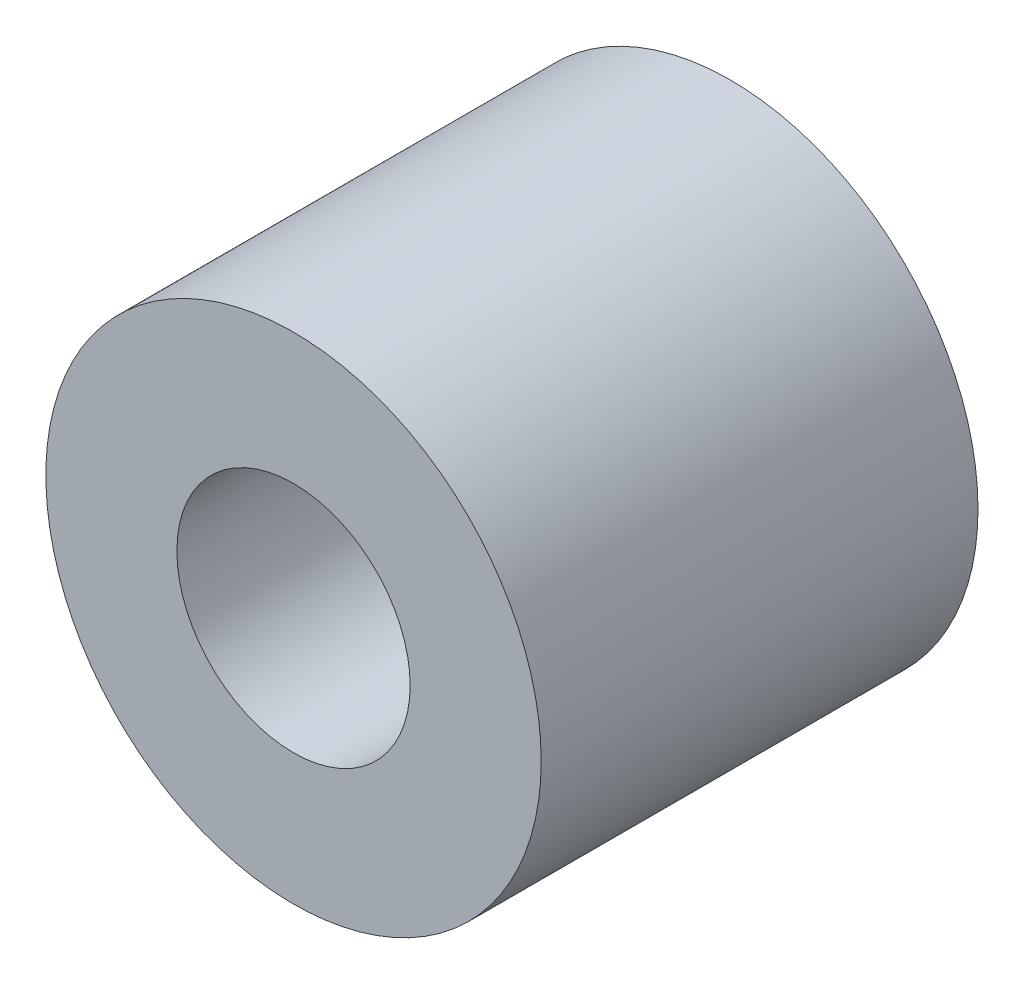
ISO-10303-21;
HEADER;
FILE_DESCRIPTION(('STEP AP214'),'2;1');
FILE_NAME('part.step','',(''),(''),'','','');
FILE_SCHEMA(('AUTOMOTIVE_DESIGN { 1 0 10303 214 1 1 1 1 }'));
ENDSEC;
DATA;
#1=APPLICATION_CONTEXT('core data for automotive mechanical design processes');
#2=APPLICATION_PROTOCOL_DEFINITION('international standard','automotive_design',2000,#1);
#3=PRODUCT_CONTEXT('',#1,'mechanical');
#4=PRODUCT('Part','Part','',(#3));
#5=PRODUCT_RELATED_PRODUCT_CATEGORY('part','',(#4));
#6=PRODUCT_DEFINITION_FORMATION('','',#4);
#7=PRODUCT_DEFINITION_CONTEXT('part definition',#1,'design');
#8=PRODUCT_DEFINITION('design','',#6,#7);
#9=PRODUCT_DEFINITION_SHAPE('','',#8);
#10=(LENGTH_UNIT() NAMED_UNIT(*) SI_UNIT(.MILLI.,.METRE.));
#11=(NAMED_UNIT(*) PLANE_ANGLE_UNIT() SI_UNIT($,.RADIAN.));
#12=(NAMED_UNIT(*) SI_UNIT($,.STERADIAN.) SOLID_ANGLE_UNIT());
#13=UNCERTAINTY_MEASURE_WITH_UNIT(LENGTH_MEASURE(1.E-05),#10,'distance_accuracy_value','');
#14=(GEOMETRIC_REPRESENTATION_CONTEXT(3) GLOBAL_UNCERTAINTY_ASSIGNED_CONTEXT((#13)) GLOBAL_UNIT_ASSIGNED_CONTEXT((#10,
#11,#12)) REPRESENTATION_CONTEXT('',''));
#15=CARTESIAN_POINT('',(0.,0.,0.));
#16=DIRECTION('',(0.,0.,1.));
#17=DIRECTION('',(1.,0.,0.));
#18=AXIS2_PLACEMENT_3D('',#15,#16,#17);
#19=CARTESIAN_POINT('',(0.,0.,5.));
#20=DIRECTION('',(0.,0.,1.));
#21=DIRECTION('',(1.,0.,0.));
#22=AXIS2_PLACEMENT_3D('',#19,#20,#21);
#23=PLANE('',#22);
#24=CARTESIAN_POINT('',(0.,0.,5.));
#25=DIRECTION('',(0.,0.,1.));
#26=DIRECTION('',(1.,0.,0.));
#27=AXIS2_PLACEMENT_3D('',#24,#25,#26);
#28=CIRCLE('',#27,2.835);
#29=CARTESIAN_POINT('',(2.835,0.,5.));
#30=VERTEX_POINT('',#29);
#31=EDGE_CURVE('E10',#30,#30,#28,.T.);
#32=ORIENTED_EDGE('',*,*,#31,.T.);
#33=EDGE_LOOP('',(#32));
#34=FACE_BOUND('',#33,.T.);
#35=CARTESIAN_POINT('',(0.,0.,5.));
#36=DIRECTION('',(0.,0.,1.));
#37=DIRECTION('',(1.,0.,0.));
#38=AXIS2_PLACEMENT_3D('',#35,#36,#37);
#39=CIRCLE('',#38,1.335);
#40=CARTESIAN_POINT('',(1.335,0.,5.));
#41=VERTEX_POINT('',#40);
#42=EDGE_CURVE('E42',#41,#41,#39,.T.);
#43=ORIENTED_EDGE('',*,*,#42,.F.);
#44=EDGE_LOOP('',(#43));
#45=FACE_BOUND('',#44,.T.);
#46=ADVANCED_FACE('F31',(#34,#45),#23,.T.);
#47=CARTESIAN_POINT('',(0.,0.,0.));
#48=DIRECTION('',(0.,0.,1.));
#49=DIRECTION('',(1.,0.,0.));
#50=AXIS2_PLACEMENT_3D('',#47,#48,#49);
#51=PLANE('',#50);
#52=CARTESIAN_POINT('',(0.,0.,0.));
#53=DIRECTION('',(0.,0.,1.));
#54=DIRECTION('',(1.,0.,0.));
#55=AXIS2_PLACEMENT_3D('',#52,#53,#54);
#56=CIRCLE('',#55,2.835);
#57=CARTESIAN_POINT('',(2.835,0.,0.));
#58=VERTEX_POINT('',#57);
#59=EDGE_CURVE('E35',#58,#58,#56,.T.);
#60=ORIENTED_EDGE('',*,*,#59,.F.);
#61=EDGE_LOOP('',(#60));
#62=FACE_BOUND('',#61,.T.);
#63=CARTESIAN_POINT('',(0.,0.,0.));
#64=DIRECTION('',(0.,0.,1.));
#65=DIRECTION('',(1.,0.,0.));
#66=AXIS2_PLACEMENT_3D('',#63,#64,#65);
#67=CIRCLE('',#66,1.335);
#68=CARTESIAN_POINT('',(1.335,0.,0.));
#69=VERTEX_POINT('',#68);
#70=EDGE_CURVE('E44',#69,#69,#67,.T.);
#71=ORIENTED_EDGE('',*,*,#70,.T.);
#72=EDGE_LOOP('',(#71));
#73=FACE_BOUND('',#72,.T.);
#74=ADVANCED_FACE('F54',(#62,#73),#51,.F.);
#75=CARTESIAN_POINT('',(0.,0.,5.));
#76=DIRECTION('',(0.,0.,-1.));
#77=DIRECTION('',(-1.,0.,0.));
#78=AXIS2_PLACEMENT_3D('',#75,#76,#77);
#79=CYLINDRICAL_SURFACE('',#78,2.835);
#80=ORIENTED_EDGE('',*,*,#31,.F.);
#81=EDGE_LOOP('',(#80));
#82=FACE_BOUND('',#81,.T.);
#83=ORIENTED_EDGE('',*,*,#59,.T.);
#84=EDGE_LOOP('',(#83));
#85=FACE_BOUND('',#84,.T.);
#86=ADVANCED_FACE('F33',(#82,#85),#79,.T.);
#87=CARTESIAN_POINT('',(0.,0.,5.));
#88=DIRECTION('',(0.,0.,-1.));
#89=DIRECTION('',(-1.,0.,0.));
#90=AXIS2_PLACEMENT_3D('',#87,#88,#89);
#91=CYLINDRICAL_SURFACE('',#90,1.335);
#92=ORIENTED_EDGE('',*,*,#42,.T.);
#93=EDGE_LOOP('',(#92));
#94=FACE_BOUND('',#93,.T.);
#95=ORIENTED_EDGE('',*,*,#70,.F.);
#96=EDGE_LOOP('',(#95));
#97=FACE_BOUND('',#96,.T.);
#98=ADVANCED_FACE('F50',(#94,#97),#91,.F.);
#99=CLOSED_SHELL('',(#46,#74,#86,#98));
#100=MANIFOLD_SOLID_BREP('B2',#99);
#101=ADVANCED_BREP_SHAPE_REPRESENTATION('',(#18,#100),#14);
#102=SHAPE_DEFINITION_REPRESENTATION(#9,#101);
ENDSEC;
END-ISO-10303-21;
